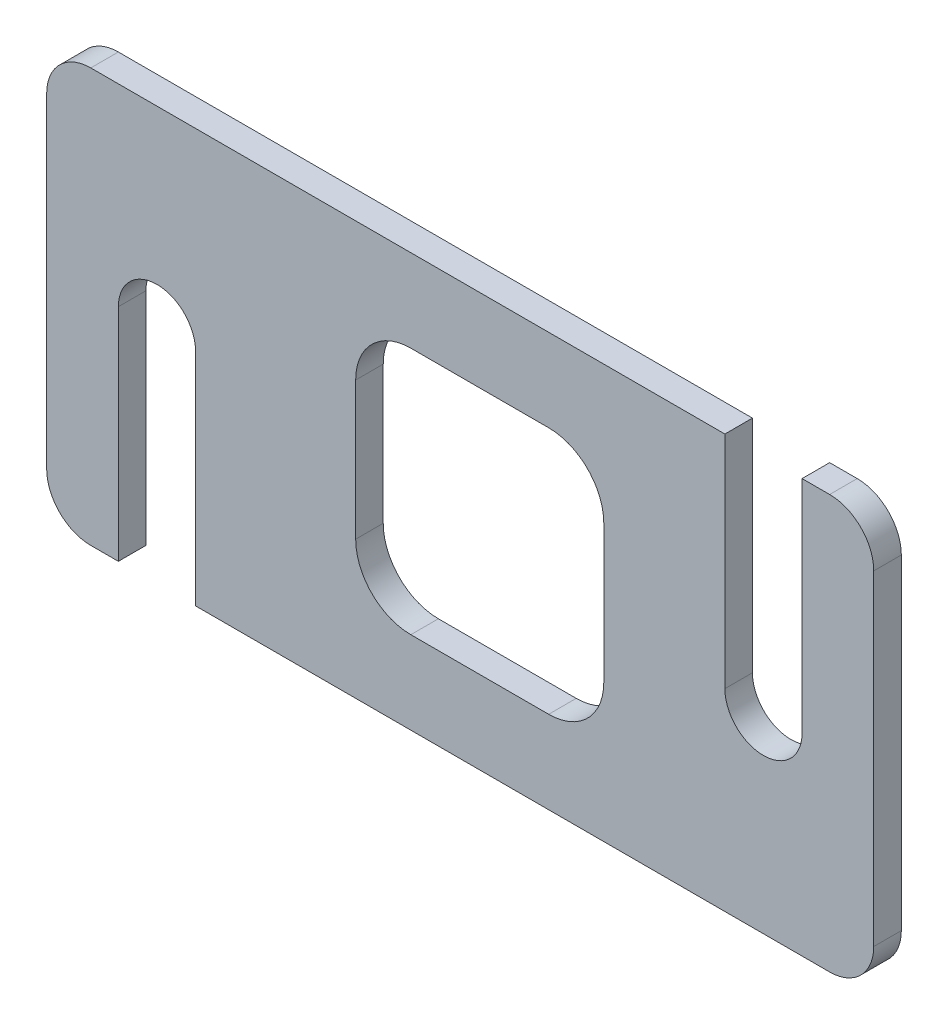
ISO-10303-21;
HEADER;
FILE_DESCRIPTION(('STEP AP214'),'2;1');
FILE_NAME('part.step','',(''),(''),'','','');
FILE_SCHEMA(('AUTOMOTIVE_DESIGN { 1 0 10303 214 1 1 1 1 }'));
ENDSEC;
DATA;
#1=APPLICATION_CONTEXT('core data for automotive mechanical design processes');
#2=APPLICATION_PROTOCOL_DEFINITION('international standard','automotive_design',2000,#1);
#3=PRODUCT_CONTEXT('',#1,'mechanical');
#4=PRODUCT('Part','Part','',(#3));
#5=PRODUCT_RELATED_PRODUCT_CATEGORY('part','',(#4));
#6=PRODUCT_DEFINITION_FORMATION('','',#4);
#7=PRODUCT_DEFINITION_CONTEXT('part definition',#1,'design');
#8=PRODUCT_DEFINITION('design','',#6,#7);
#9=PRODUCT_DEFINITION_SHAPE('','',#8);
#10=(LENGTH_UNIT() NAMED_UNIT(*) SI_UNIT(.MILLI.,.METRE.));
#11=(NAMED_UNIT(*) PLANE_ANGLE_UNIT() SI_UNIT($,.RADIAN.));
#12=(NAMED_UNIT(*) SI_UNIT($,.STERADIAN.) SOLID_ANGLE_UNIT());
#13=UNCERTAINTY_MEASURE_WITH_UNIT(LENGTH_MEASURE(1.E-05),#10,'distance_accuracy_value','');
#14=(GEOMETRIC_REPRESENTATION_CONTEXT(3) GLOBAL_UNCERTAINTY_ASSIGNED_CONTEXT((#13)) GLOBAL_UNIT_ASSIGNED_CONTEXT((#10,
#11,#12)) REPRESENTATION_CONTEXT('',''));
#15=CARTESIAN_POINT('',(0.,0.,0.));
#16=DIRECTION('',(0.,0.,1.));
#17=DIRECTION('',(1.,0.,0.));
#18=AXIS2_PLACEMENT_3D('',#15,#16,#17);
#19=CARTESIAN_POINT('',(150.,75.,5.));
#20=DIRECTION('',(0.,-1.,0.));
#21=DIRECTION('',(1.,0.,0.));
#22=AXIS2_PLACEMENT_3D('',#19,#20,#21);
#23=PLANE('',#22);
#24=DIRECTION('',(-1.,0.,0.));
#25=VECTOR('',#24,1.);
#26=CARTESIAN_POINT('',(150.,75.,5.));
#27=LINE('',#26,#25);
#28=CARTESIAN_POINT('',(142.,75.,5.));
#29=VERTEX_POINT('',#28);
#30=CARTESIAN_POINT('',(137.,75.,5.));
#31=VERTEX_POINT('',#30);
#32=EDGE_CURVE('E299',#29,#31,#27,.T.);
#33=ORIENTED_EDGE('',*,*,#32,.F.);
#34=DIRECTION('',(0.,0.,-1.));
#35=VECTOR('',#34,1.);
#36=CARTESIAN_POINT('',(142.,75.,5.));
#37=LINE('',#36,#35);
#38=CARTESIAN_POINT('',(142.,75.,0.));
#39=VERTEX_POINT('',#38);
#40=EDGE_CURVE('E335',#29,#39,#37,.T.);
#41=ORIENTED_EDGE('',*,*,#40,.T.);
#42=DIRECTION('',(-1.,0.,0.));
#43=VECTOR('',#42,1.);
#44=CARTESIAN_POINT('',(150.,75.,0.));
#45=LINE('',#44,#43);
#46=CARTESIAN_POINT('',(137.,75.,0.));
#47=VERTEX_POINT('',#46);
#48=EDGE_CURVE('E293',#39,#47,#45,.T.);
#49=ORIENTED_EDGE('',*,*,#48,.T.);
#50=DIRECTION('',(0.,0.,-1.));
#51=VECTOR('',#50,1.);
#52=CARTESIAN_POINT('',(137.,75.,220.974521694531));
#53=LINE('',#52,#51);
#54=EDGE_CURVE('E211',#31,#47,#53,.T.);
#55=ORIENTED_EDGE('',*,*,#54,.F.);
#56=EDGE_LOOP('',(#33,#41,#49,#55));
#57=FACE_BOUND('',#56,.T.);
#58=ADVANCED_FACE('F32',(#57),#23,.F.);
#59=CARTESIAN_POINT('',(0.,0.,5.));
#60=DIRECTION('',(0.,0.,1.));
#61=DIRECTION('',(1.,0.,0.));
#62=AXIS2_PLACEMENT_3D('',#59,#60,#61);
#63=PLANE('',#62);
#64=DIRECTION('',(1.,0.,0.));
#65=VECTOR('',#64,1.);
#66=CARTESIAN_POINT('',(66.0398643162599,15.,5.));
#67=LINE('',#66,#65);
#68=CARTESIAN_POINT('',(66.0398643162599,15.,5.));
#69=VERTEX_POINT('',#68);
#70=CARTESIAN_POINT('',(91.0398643162599,15.,5.));
#71=VERTEX_POINT('',#70);
#72=EDGE_CURVE('E232',#69,#71,#67,.T.);
#73=ORIENTED_EDGE('',*,*,#72,.F.);
#74=CARTESIAN_POINT('',(66.0398643162599,25.,5.));
#75=DIRECTION('',(0.,0.,1.));
#76=DIRECTION('',(1.,0.,0.));
#77=AXIS2_PLACEMENT_3D('',#74,#75,#76);
#78=CIRCLE('',#77,10.);
#79=CARTESIAN_POINT('',(56.0398643162599,25.,5.));
#80=VERTEX_POINT('',#79);
#81=EDGE_CURVE('E230',#80,#69,#78,.T.);
#82=ORIENTED_EDGE('',*,*,#81,.F.);
#83=DIRECTION('',(0.,-1.,0.));
#84=VECTOR('',#83,1.);
#85=CARTESIAN_POINT('',(56.0398643162599,50.,5.));
#86=LINE('',#85,#84);
#87=CARTESIAN_POINT('',(56.0398643162599,50.,5.));
#88=VERTEX_POINT('',#87);
#89=EDGE_CURVE('E247',#88,#80,#86,.T.);
#90=ORIENTED_EDGE('',*,*,#89,.F.);
#91=CARTESIAN_POINT('',(66.0398643162599,50.,5.));
#92=DIRECTION('',(0.,0.,-1.));
#93=DIRECTION('',(-1.,0.,0.));
#94=AXIS2_PLACEMENT_3D('',#91,#92,#93);
#95=CIRCLE('',#94,10.);
#96=CARTESIAN_POINT('',(66.0398643162599,60.,5.));
#97=VERTEX_POINT('',#96);
#98=EDGE_CURVE('E244',#88,#97,#95,.T.);
#99=ORIENTED_EDGE('',*,*,#98,.T.);
#100=DIRECTION('',(-1.,0.,0.));
#101=VECTOR('',#100,1.);
#102=CARTESIAN_POINT('',(91.0398643162599,60.,5.));
#103=LINE('',#102,#101);
#104=CARTESIAN_POINT('',(91.0398643162599,60.,5.));
#105=VERTEX_POINT('',#104);
#106=EDGE_CURVE('E242',#105,#97,#103,.T.);
#107=ORIENTED_EDGE('',*,*,#106,.F.);
#108=CARTESIAN_POINT('',(91.0398643162599,50.,5.));
#109=DIRECTION('',(0.,0.,1.));
#110=DIRECTION('',(1.,0.,0.));
#111=AXIS2_PLACEMENT_3D('',#108,#109,#110);
#112=CIRCLE('',#111,10.);
#113=CARTESIAN_POINT('',(101.03986431626,50.,5.));
#114=VERTEX_POINT('',#113);
#115=EDGE_CURVE('E240',#114,#105,#112,.T.);
#116=ORIENTED_EDGE('',*,*,#115,.F.);
#117=DIRECTION('',(0.,1.,0.));
#118=VECTOR('',#117,1.);
#119=CARTESIAN_POINT('',(101.03986431626,25.,5.));
#120=LINE('',#119,#118);
#121=CARTESIAN_POINT('',(101.03986431626,25.,5.));
#122=VERTEX_POINT('',#121);
#123=EDGE_CURVE('E238',#122,#114,#120,.T.);
#124=ORIENTED_EDGE('',*,*,#123,.F.);
#125=CARTESIAN_POINT('',(91.0398643162599,25.,5.));
#126=DIRECTION('',(0.,0.,-1.));
#127=DIRECTION('',(-1.,0.,0.));
#128=AXIS2_PLACEMENT_3D('',#125,#126,#127);
#129=CIRCLE('',#128,10.);
#130=EDGE_CURVE('E235',#122,#71,#129,.T.);
#131=ORIENTED_EDGE('',*,*,#130,.T.);
#132=EDGE_LOOP('',(#73,#82,#90,#99,#107,#116,#124,#131));
#133=FACE_BOUND('',#132,.T.);
#134=CARTESIAN_POINT('',(123.,75.,5.));
#135=VERTEX_POINT('',#134);
#136=CARTESIAN_POINT('',(8.00000000000001,75.,5.));
#137=VERTEX_POINT('',#136);
#138=EDGE_CURVE('E298',#135,#137,#27,.T.);
#139=ORIENTED_EDGE('',*,*,#138,.T.);
#140=CARTESIAN_POINT('',(8.,67.,5.));
#141=DIRECTION('',(0.,0.,1.));
#142=DIRECTION('',(1.,0.,0.));
#143=AXIS2_PLACEMENT_3D('',#140,#141,#142);
#144=CIRCLE('',#143,8.);
#145=CARTESIAN_POINT('',(0.,67.,5.));
#146=VERTEX_POINT('',#145);
#147=EDGE_CURVE('E11',#137,#146,#144,.T.);
#148=ORIENTED_EDGE('',*,*,#147,.T.);
#149=DIRECTION('',(0.,-1.,0.));
#150=VECTOR('',#149,1.);
#151=CARTESIAN_POINT('',(0.,75.,5.));
#152=LINE('',#151,#150);
#153=CARTESIAN_POINT('',(0.,7.99999999999999,5.));
#154=VERTEX_POINT('',#153);
#155=EDGE_CURVE('E290',#146,#154,#152,.T.);
#156=ORIENTED_EDGE('',*,*,#155,.T.);
#157=CARTESIAN_POINT('',(8.,8.,5.));
#158=DIRECTION('',(0.,0.,1.));
#159=DIRECTION('',(1.,0.,0.));
#160=AXIS2_PLACEMENT_3D('',#157,#158,#159);
#161=CIRCLE('',#160,8.);
#162=CARTESIAN_POINT('',(8.,0.,5.));
#163=VERTEX_POINT('',#162);
#164=EDGE_CURVE('E355',#154,#163,#161,.T.);
#165=ORIENTED_EDGE('',*,*,#164,.T.);
#166=DIRECTION('',(1.,0.,0.));
#167=VECTOR('',#166,1.);
#168=CARTESIAN_POINT('',(0.,0.,5.));
#169=LINE('',#168,#167);
#170=CARTESIAN_POINT('',(13.,0.,5.));
#171=VERTEX_POINT('',#170);
#172=EDGE_CURVE('E294',#163,#171,#169,.T.);
#173=ORIENTED_EDGE('',*,*,#172,.T.);
#174=DIRECTION('',(0.,1.,0.));
#175=VECTOR('',#174,1.);
#176=CARTESIAN_POINT('',(13.,0.,5.));
#177=LINE('',#176,#175);
#178=CARTESIAN_POINT('',(13.,40.,5.));
#179=VERTEX_POINT('',#178);
#180=EDGE_CURVE('E276',#171,#179,#177,.T.);
#181=ORIENTED_EDGE('',*,*,#180,.T.);
#182=CARTESIAN_POINT('',(20.,40.,5.));
#183=DIRECTION('',(0.,0.,1.));
#184=DIRECTION('',(1.,0.,0.));
#185=AXIS2_PLACEMENT_3D('',#182,#183,#184);
#186=CIRCLE('',#185,7.);
#187=CARTESIAN_POINT('',(27.,40.,5.));
#188=VERTEX_POINT('',#187);
#189=EDGE_CURVE('E287',#188,#179,#186,.T.);
#190=ORIENTED_EDGE('',*,*,#189,.F.);
#191=DIRECTION('',(0.,1.,0.));
#192=VECTOR('',#191,1.);
#193=CARTESIAN_POINT('',(27.,0.,5.));
#194=LINE('',#193,#192);
#195=CARTESIAN_POINT('',(27.,0.,5.));
#196=VERTEX_POINT('',#195);
#197=EDGE_CURVE('E233',#196,#188,#194,.T.);
#198=ORIENTED_EDGE('',*,*,#197,.F.);
#199=CARTESIAN_POINT('',(142.,0.,5.));
#200=VERTEX_POINT('',#199);
#201=EDGE_CURVE('E292',#196,#200,#169,.T.);
#202=ORIENTED_EDGE('',*,*,#201,.T.);
#203=CARTESIAN_POINT('',(142.,8.,5.));
#204=DIRECTION('',(0.,0.,1.));
#205=DIRECTION('',(1.,0.,0.));
#206=AXIS2_PLACEMENT_3D('',#203,#204,#205);
#207=CIRCLE('',#206,8.);
#208=CARTESIAN_POINT('',(150.,8.,5.));
#209=VERTEX_POINT('',#208);
#210=EDGE_CURVE('E364',#200,#209,#207,.T.);
#211=ORIENTED_EDGE('',*,*,#210,.T.);
#212=DIRECTION('',(0.,1.,0.));
#213=VECTOR('',#212,1.);
#214=CARTESIAN_POINT('',(150.,0.,5.));
#215=LINE('',#214,#213);
#216=CARTESIAN_POINT('',(150.,67.,5.));
#217=VERTEX_POINT('',#216);
#218=EDGE_CURVE('E296',#209,#217,#215,.T.);
#219=ORIENTED_EDGE('',*,*,#218,.T.);
#220=CARTESIAN_POINT('',(142.,67.,5.));
#221=DIRECTION('',(0.,0.,1.));
#222=DIRECTION('',(1.,0.,0.));
#223=AXIS2_PLACEMENT_3D('',#220,#221,#222);
#224=CIRCLE('',#223,8.);
#225=EDGE_CURVE('E344',#217,#29,#224,.T.);
#226=ORIENTED_EDGE('',*,*,#225,.T.);
#227=ORIENTED_EDGE('',*,*,#32,.T.);
#228=DIRECTION('',(0.,-1.,0.));
#229=VECTOR('',#228,1.);
#230=CARTESIAN_POINT('',(137.,0.,5.));
#231=LINE('',#230,#229);
#232=CARTESIAN_POINT('',(137.,35.,5.));
#233=VERTEX_POINT('',#232);
#234=EDGE_CURVE('E224',#31,#233,#231,.T.);
#235=ORIENTED_EDGE('',*,*,#234,.T.);
#236=CARTESIAN_POINT('',(130.,35.,5.));
#237=DIRECTION('',(0.,0.,1.));
#238=DIRECTION('',(1.,0.,0.));
#239=AXIS2_PLACEMENT_3D('',#236,#237,#238);
#240=CIRCLE('',#239,7.00000000000002);
#241=CARTESIAN_POINT('',(123.,35.,5.));
#242=VERTEX_POINT('',#241);
#243=EDGE_CURVE('E216',#233,#242,#240,.F.);
#244=ORIENTED_EDGE('',*,*,#243,.T.);
#245=DIRECTION('',(0.,1.,0.));
#246=VECTOR('',#245,1.);
#247=CARTESIAN_POINT('',(123.,0.,5.));
#248=LINE('',#247,#246);
#249=EDGE_CURVE('E227',#242,#135,#248,.T.);
#250=ORIENTED_EDGE('',*,*,#249,.T.);
#251=EDGE_LOOP('',(#139,#148,#156,#165,#173,#181,#190,#198,#202,#211,#219,#226,#227,#235,#244,#250));
#252=FACE_BOUND('',#251,.T.);
#253=ADVANCED_FACE('F383',(#133,#252),#63,.T.);
#254=CARTESIAN_POINT('',(0.,0.,0.));
#255=DIRECTION('',(0.,0.,1.));
#256=DIRECTION('',(1.,0.,0.));
#257=AXIS2_PLACEMENT_3D('',#254,#255,#256);
#258=PLANE('',#257);
#259=CARTESIAN_POINT('',(66.0398643162599,25.,0.));
#260=DIRECTION('',(0.,0.,-1.));
#261=DIRECTION('',(-1.,0.,0.));
#262=AXIS2_PLACEMENT_3D('',#259,#260,#261);
#263=CIRCLE('',#262,10.);
#264=CARTESIAN_POINT('',(66.0398643162599,15.,0.));
#265=VERTEX_POINT('',#264);
#266=CARTESIAN_POINT('',(56.0398643162599,25.,0.));
#267=VERTEX_POINT('',#266);
#268=EDGE_CURVE('E212',#265,#267,#263,.T.);
#269=ORIENTED_EDGE('',*,*,#268,.F.);
#270=DIRECTION('',(1.,0.,0.));
#271=VECTOR('',#270,1.);
#272=CARTESIAN_POINT('',(66.0398643162599,15.,0.));
#273=LINE('',#272,#271);
#274=CARTESIAN_POINT('',(91.0398643162599,15.,0.));
#275=VERTEX_POINT('',#274);
#276=EDGE_CURVE('E330',#275,#265,#273,.F.);
#277=ORIENTED_EDGE('',*,*,#276,.F.);
#278=CARTESIAN_POINT('',(91.0398643162599,25.,0.));
#279=DIRECTION('',(0.,0.,-1.));
#280=DIRECTION('',(-1.,0.,0.));
#281=AXIS2_PLACEMENT_3D('',#278,#279,#280);
#282=CIRCLE('',#281,10.);
#283=CARTESIAN_POINT('',(101.03986431626,25.,0.));
#284=VERTEX_POINT('',#283);
#285=EDGE_CURVE('E327',#275,#284,#282,.F.);
#286=ORIENTED_EDGE('',*,*,#285,.T.);
#287=DIRECTION('',(0.,1.,0.));
#288=VECTOR('',#287,1.);
#289=CARTESIAN_POINT('',(101.03986431626,25.,0.));
#290=LINE('',#289,#288);
#291=CARTESIAN_POINT('',(101.03986431626,50.,0.));
#292=VERTEX_POINT('',#291);
#293=EDGE_CURVE('E325',#292,#284,#290,.F.);
#294=ORIENTED_EDGE('',*,*,#293,.F.);
#295=CARTESIAN_POINT('',(91.0398643162599,50.,0.));
#296=DIRECTION('',(0.,0.,-1.));
#297=DIRECTION('',(-1.,0.,0.));
#298=AXIS2_PLACEMENT_3D('',#295,#296,#297);
#299=CIRCLE('',#298,10.);
#300=CARTESIAN_POINT('',(91.0398643162599,60.,0.));
#301=VERTEX_POINT('',#300);
#302=EDGE_CURVE('E323',#301,#292,#299,.T.);
#303=ORIENTED_EDGE('',*,*,#302,.F.);
#304=DIRECTION('',(1.,0.,0.));
#305=VECTOR('',#304,1.);
#306=CARTESIAN_POINT('',(91.0398643162599,60.,0.));
#307=LINE('',#306,#305);
#308=CARTESIAN_POINT('',(66.0398643162599,60.,0.));
#309=VERTEX_POINT('',#308);
#310=EDGE_CURVE('E321',#309,#301,#307,.T.);
#311=ORIENTED_EDGE('',*,*,#310,.F.);
#312=CARTESIAN_POINT('',(66.0398643162599,50.,0.));
#313=DIRECTION('',(0.,0.,-1.));
#314=DIRECTION('',(-1.,0.,0.));
#315=AXIS2_PLACEMENT_3D('',#312,#313,#314);
#316=CIRCLE('',#315,10.);
#317=CARTESIAN_POINT('',(56.0398643162599,50.,0.));
#318=VERTEX_POINT('',#317);
#319=EDGE_CURVE('E318',#309,#318,#316,.F.);
#320=ORIENTED_EDGE('',*,*,#319,.T.);
#321=DIRECTION('',(0.,1.,0.));
#322=VECTOR('',#321,1.);
#323=CARTESIAN_POINT('',(56.0398643162599,50.,0.));
#324=LINE('',#323,#322);
#325=EDGE_CURVE('E316',#267,#318,#324,.T.);
#326=ORIENTED_EDGE('',*,*,#325,.F.);
#327=EDGE_LOOP('',(#269,#277,#286,#294,#303,#311,#320,#326));
#328=FACE_BOUND('',#327,.T.);
#329=DIRECTION('',(0.,-1.,0.));
#330=VECTOR('',#329,1.);
#331=CARTESIAN_POINT('',(0.,75.,0.));
#332=LINE('',#331,#330);
#333=CARTESIAN_POINT('',(0.,67.,0.));
#334=VERTEX_POINT('',#333);
#335=CARTESIAN_POINT('',(0.,7.99999999999999,0.));
#336=VERTEX_POINT('',#335);
#337=EDGE_CURVE('E253',#334,#336,#332,.T.);
#338=ORIENTED_EDGE('',*,*,#337,.F.);
#339=CARTESIAN_POINT('',(8.,67.,0.));
#340=DIRECTION('',(0.,0.,1.));
#341=DIRECTION('',(1.,0.,0.));
#342=AXIS2_PLACEMENT_3D('',#339,#340,#341);
#343=CIRCLE('',#342,8.);
#344=CARTESIAN_POINT('',(8.00000000000001,75.,0.));
#345=VERTEX_POINT('',#344);
#346=EDGE_CURVE('E54',#334,#345,#343,.F.);
#347=ORIENTED_EDGE('',*,*,#346,.T.);
#348=CARTESIAN_POINT('',(123.,75.,0.));
#349=VERTEX_POINT('',#348);
#350=EDGE_CURVE('E308',#349,#345,#45,.T.);
#351=ORIENTED_EDGE('',*,*,#350,.F.);
#352=DIRECTION('',(0.,1.,0.));
#353=VECTOR('',#352,1.);
#354=CARTESIAN_POINT('',(123.,0.,0.));
#355=LINE('',#354,#353);
#356=CARTESIAN_POINT('',(123.,35.,0.));
#357=VERTEX_POINT('',#356);
#358=EDGE_CURVE('E199',#357,#349,#355,.T.);
#359=ORIENTED_EDGE('',*,*,#358,.F.);
#360=CARTESIAN_POINT('',(130.,35.,0.));
#361=DIRECTION('',(0.,0.,1.));
#362=DIRECTION('',(1.,0.,0.));
#363=AXIS2_PLACEMENT_3D('',#360,#361,#362);
#364=CIRCLE('',#363,7.00000000000002);
#365=CARTESIAN_POINT('',(137.,35.,0.));
#366=VERTEX_POINT('',#365);
#367=EDGE_CURVE('E192',#366,#357,#364,.F.);
#368=ORIENTED_EDGE('',*,*,#367,.F.);
#369=DIRECTION('',(0.,-1.,0.));
#370=VECTOR('',#369,1.);
#371=CARTESIAN_POINT('',(137.,0.,0.));
#372=LINE('',#371,#370);
#373=EDGE_CURVE('E196',#47,#366,#372,.T.);
#374=ORIENTED_EDGE('',*,*,#373,.F.);
#375=ORIENTED_EDGE('',*,*,#48,.F.);
#376=CARTESIAN_POINT('',(142.,67.,0.));
#377=DIRECTION('',(0.,0.,1.));
#378=DIRECTION('',(1.,0.,0.));
#379=AXIS2_PLACEMENT_3D('',#376,#377,#378);
#380=CIRCLE('',#379,8.);
#381=CARTESIAN_POINT('',(150.,67.,0.));
#382=VERTEX_POINT('',#381);
#383=EDGE_CURVE('E338',#39,#382,#380,.F.);
#384=ORIENTED_EDGE('',*,*,#383,.T.);
#385=DIRECTION('',(0.,1.,0.));
#386=VECTOR('',#385,1.);
#387=CARTESIAN_POINT('',(150.,0.,0.));
#388=LINE('',#387,#386);
#389=CARTESIAN_POINT('',(150.,8.,0.));
#390=VERTEX_POINT('',#389);
#391=EDGE_CURVE('E306',#390,#382,#388,.T.);
#392=ORIENTED_EDGE('',*,*,#391,.F.);
#393=CARTESIAN_POINT('',(142.,8.,0.));
#394=DIRECTION('',(0.,0.,1.));
#395=DIRECTION('',(1.,0.,0.));
#396=AXIS2_PLACEMENT_3D('',#393,#394,#395);
#397=CIRCLE('',#396,8.);
#398=CARTESIAN_POINT('',(142.,0.,0.));
#399=VERTEX_POINT('',#398);
#400=EDGE_CURVE('E360',#390,#399,#397,.F.);
#401=ORIENTED_EDGE('',*,*,#400,.T.);
#402=DIRECTION('',(1.,0.,0.));
#403=VECTOR('',#402,1.);
#404=CARTESIAN_POINT('',(0.,0.,0.));
#405=LINE('',#404,#403);
#406=CARTESIAN_POINT('',(27.,0.,0.));
#407=VERTEX_POINT('',#406);
#408=EDGE_CURVE('E303',#407,#399,#405,.T.);
#409=ORIENTED_EDGE('',*,*,#408,.F.);
#410=DIRECTION('',(0.,1.,0.));
#411=VECTOR('',#410,1.);
#412=CARTESIAN_POINT('',(27.,0.,0.));
#413=LINE('',#412,#411);
#414=CARTESIAN_POINT('',(27.,40.,0.));
#415=VERTEX_POINT('',#414);
#416=EDGE_CURVE('E314',#415,#407,#413,.F.);
#417=ORIENTED_EDGE('',*,*,#416,.F.);
#418=CARTESIAN_POINT('',(20.,40.,0.));
#419=DIRECTION('',(0.,0.,-1.));
#420=DIRECTION('',(-1.,0.,0.));
#421=AXIS2_PLACEMENT_3D('',#418,#419,#420);
#422=CIRCLE('',#421,7.);
#423=CARTESIAN_POINT('',(13.,40.,0.));
#424=VERTEX_POINT('',#423);
#425=EDGE_CURVE('E312',#424,#415,#422,.T.);
#426=ORIENTED_EDGE('',*,*,#425,.F.);
#427=DIRECTION('',(0.,1.,0.));
#428=VECTOR('',#427,1.);
#429=CARTESIAN_POINT('',(13.,0.,0.));
#430=LINE('',#429,#428);
#431=CARTESIAN_POINT('',(13.,0.,0.));
#432=VERTEX_POINT('',#431);
#433=EDGE_CURVE('E301',#424,#432,#430,.F.);
#434=ORIENTED_EDGE('',*,*,#433,.T.);
#435=CARTESIAN_POINT('',(8.,0.,0.));
#436=VERTEX_POINT('',#435);
#437=EDGE_CURVE('E304',#436,#432,#405,.T.);
#438=ORIENTED_EDGE('',*,*,#437,.F.);
#439=CARTESIAN_POINT('',(8.,8.,0.));
#440=DIRECTION('',(0.,0.,1.));
#441=DIRECTION('',(1.,0.,0.));
#442=AXIS2_PLACEMENT_3D('',#439,#440,#441);
#443=CIRCLE('',#442,8.);
#444=EDGE_CURVE('E349',#436,#336,#443,.F.);
#445=ORIENTED_EDGE('',*,*,#444,.T.);
#446=EDGE_LOOP('',(#338,#347,#351,#359,#368,#374,#375,#384,#392,#401,#409,#417,#426,#434,#438,#445));
#447=FACE_BOUND('',#446,.T.);
#448=ADVANCED_FACE('F194',(#328,#447),#258,.F.);
#449=CARTESIAN_POINT('',(0.,0.,5.));
#450=DIRECTION('',(0.,1.,0.));
#451=DIRECTION('',(0.,0.,1.));
#452=AXIS2_PLACEMENT_3D('',#449,#450,#451);
#453=PLANE('',#452);
#454=ORIENTED_EDGE('',*,*,#408,.T.);
#455=DIRECTION('',(0.,0.,-1.));
#456=VECTOR('',#455,1.);
#457=CARTESIAN_POINT('',(142.,0.,5.));
#458=LINE('',#457,#456);
#459=EDGE_CURVE('E362',#399,#200,#458,.F.);
#460=ORIENTED_EDGE('',*,*,#459,.T.);
#461=ORIENTED_EDGE('',*,*,#201,.F.);
#462=DIRECTION('',(0.,0.,-1.));
#463=VECTOR('',#462,1.);
#464=CARTESIAN_POINT('',(27.,0.,5.));
#465=LINE('',#464,#463);
#466=EDGE_CURVE('E229',#196,#407,#465,.T.);
#467=ORIENTED_EDGE('',*,*,#466,.T.);
#468=EDGE_LOOP('',(#454,#460,#461,#467));
#469=FACE_BOUND('',#468,.T.);
#470=ADVANCED_FACE('F406',(#469),#453,.F.);
#471=CARTESIAN_POINT('',(0.,75.,5.));
#472=DIRECTION('',(1.,0.,0.));
#473=DIRECTION('',(0.,1.,0.));
#474=AXIS2_PLACEMENT_3D('',#471,#472,#473);
#475=PLANE('',#474);
#476=ORIENTED_EDGE('',*,*,#155,.F.);
#477=DIRECTION('',(0.,0.,-1.));
#478=VECTOR('',#477,1.);
#479=CARTESIAN_POINT('',(0.,67.,5.));
#480=LINE('',#479,#478);
#481=EDGE_CURVE('E366',#146,#334,#480,.T.);
#482=ORIENTED_EDGE('',*,*,#481,.T.);
#483=ORIENTED_EDGE('',*,*,#337,.T.);
#484=DIRECTION('',(0.,0.,-1.));
#485=VECTOR('',#484,1.);
#486=CARTESIAN_POINT('',(0.,7.99999999999999,5.));
#487=LINE('',#486,#485);
#488=EDGE_CURVE('E352',#336,#154,#487,.F.);
#489=ORIENTED_EDGE('',*,*,#488,.T.);
#490=EDGE_LOOP('',(#476,#482,#483,#489));
#491=FACE_BOUND('',#490,.T.);
#492=ADVANCED_FACE('F372',(#491),#475,.F.);
#493=ORIENTED_EDGE('',*,*,#172,.F.);
#494=DIRECTION('',(0.,0.,-1.));
#495=VECTOR('',#494,1.);
#496=CARTESIAN_POINT('',(8.,0.,5.));
#497=LINE('',#496,#495);
#498=EDGE_CURVE('E346',#163,#436,#497,.T.);
#499=ORIENTED_EDGE('',*,*,#498,.T.);
#500=ORIENTED_EDGE('',*,*,#437,.T.);
#501=DIRECTION('',(0.,0.,-1.));
#502=VECTOR('',#501,1.);
#503=CARTESIAN_POINT('',(13.,0.,5.));
#504=LINE('',#503,#502);
#505=EDGE_CURVE('E273',#171,#432,#504,.T.);
#506=ORIENTED_EDGE('',*,*,#505,.F.);
#507=EDGE_LOOP('',(#493,#499,#500,#506));
#508=FACE_BOUND('',#507,.T.);
#509=ADVANCED_FACE('F387',(#508),#453,.F.);
#510=CARTESIAN_POINT('',(150.,0.,5.));
#511=DIRECTION('',(-1.,0.,0.));
#512=DIRECTION('',(0.,0.,1.));
#513=AXIS2_PLACEMENT_3D('',#510,#511,#512);
#514=PLANE('',#513);
#515=ORIENTED_EDGE('',*,*,#218,.F.);
#516=DIRECTION('',(0.,0.,-1.));
#517=VECTOR('',#516,1.);
#518=CARTESIAN_POINT('',(150.,8.,5.));
#519=LINE('',#518,#517);
#520=EDGE_CURVE('E357',#209,#390,#519,.T.);
#521=ORIENTED_EDGE('',*,*,#520,.T.);
#522=ORIENTED_EDGE('',*,*,#391,.T.);
#523=DIRECTION('',(0.,0.,-1.));
#524=VECTOR('',#523,1.);
#525=CARTESIAN_POINT('',(150.,67.,5.));
#526=LINE('',#525,#524);
#527=EDGE_CURVE('E341',#382,#217,#526,.F.);
#528=ORIENTED_EDGE('',*,*,#527,.T.);
#529=EDGE_LOOP('',(#515,#521,#522,#528));
#530=FACE_BOUND('',#529,.T.);
#531=ADVANCED_FACE('F413',(#530),#514,.F.);
#532=ORIENTED_EDGE('',*,*,#350,.T.);
#533=DIRECTION('',(0.,0.,-1.));
#534=VECTOR('',#533,1.);
#535=CARTESIAN_POINT('',(8.00000000000001,75.,5.));
#536=LINE('',#535,#534);
#537=EDGE_CURVE('E40',#345,#137,#536,.F.);
#538=ORIENTED_EDGE('',*,*,#537,.T.);
#539=ORIENTED_EDGE('',*,*,#138,.F.);
#540=DIRECTION('',(0.,0.,-1.));
#541=VECTOR('',#540,1.);
#542=CARTESIAN_POINT('',(123.,75.,220.974521694531));
#543=LINE('',#542,#541);
#544=EDGE_CURVE('E222',#135,#349,#543,.T.);
#545=ORIENTED_EDGE('',*,*,#544,.T.);
#546=EDGE_LOOP('',(#532,#538,#539,#545));
#547=FACE_BOUND('',#546,.T.);
#548=ADVANCED_FACE('F426',(#547),#23,.F.);
#549=CARTESIAN_POINT('',(27.,0.,5.));
#550=DIRECTION('',(-1.,0.,0.));
#551=DIRECTION('',(0.,0.,1.));
#552=AXIS2_PLACEMENT_3D('',#549,#550,#551);
#553=PLANE('',#552);
#554=ORIENTED_EDGE('',*,*,#416,.T.);
#555=ORIENTED_EDGE('',*,*,#466,.F.);
#556=ORIENTED_EDGE('',*,*,#197,.T.);
#557=DIRECTION('',(0.,0.,-1.));
#558=VECTOR('',#557,1.);
#559=CARTESIAN_POINT('',(27.,40.,5.));
#560=LINE('',#559,#558);
#561=EDGE_CURVE('E280',#188,#415,#560,.T.);
#562=ORIENTED_EDGE('',*,*,#561,.T.);
#563=EDGE_LOOP('',(#554,#555,#556,#562));
#564=FACE_BOUND('',#563,.T.);
#565=ADVANCED_FACE('F399',(#564),#553,.T.);
#566=CARTESIAN_POINT('',(20.,40.,5.));
#567=DIRECTION('',(0.,0.,-1.));
#568=DIRECTION('',(-1.,0.,0.));
#569=AXIS2_PLACEMENT_3D('',#566,#567,#568);
#570=CYLINDRICAL_SURFACE('',#569,7.);
#571=ORIENTED_EDGE('',*,*,#425,.T.);
#572=ORIENTED_EDGE('',*,*,#561,.F.);
#573=ORIENTED_EDGE('',*,*,#189,.T.);
#574=DIRECTION('',(0.,0.,-1.));
#575=VECTOR('',#574,1.);
#576=CARTESIAN_POINT('',(13.,40.,5.));
#577=LINE('',#576,#575);
#578=EDGE_CURVE('E277',#179,#424,#577,.T.);
#579=ORIENTED_EDGE('',*,*,#578,.T.);
#580=EDGE_LOOP('',(#571,#572,#573,#579));
#581=FACE_BOUND('',#580,.T.);
#582=ADVANCED_FACE('F396',(#581),#570,.F.);
#583=CARTESIAN_POINT('',(13.,0.,5.));
#584=DIRECTION('',(-1.,0.,0.));
#585=DIRECTION('',(0.,0.,1.));
#586=AXIS2_PLACEMENT_3D('',#583,#584,#585);
#587=PLANE('',#586);
#588=ORIENTED_EDGE('',*,*,#578,.F.);
#589=ORIENTED_EDGE('',*,*,#180,.F.);
#590=ORIENTED_EDGE('',*,*,#505,.T.);
#591=ORIENTED_EDGE('',*,*,#433,.F.);
#592=EDGE_LOOP('',(#588,#589,#590,#591));
#593=FACE_BOUND('',#592,.T.);
#594=ADVANCED_FACE('F390',(#593),#587,.F.);
#595=CARTESIAN_POINT('',(66.0398643162599,25.,5.));
#596=DIRECTION('',(0.,0.,-1.));
#597=DIRECTION('',(-1.,0.,0.));
#598=AXIS2_PLACEMENT_3D('',#595,#596,#597);
#599=CYLINDRICAL_SURFACE('',#598,10.);
#600=ORIENTED_EDGE('',*,*,#268,.T.);
#601=DIRECTION('',(0.,0.,-1.));
#602=VECTOR('',#601,1.);
#603=CARTESIAN_POINT('',(56.0398643162599,25.,5.));
#604=LINE('',#603,#602);
#605=EDGE_CURVE('E249',#80,#267,#604,.T.);
#606=ORIENTED_EDGE('',*,*,#605,.F.);
#607=ORIENTED_EDGE('',*,*,#81,.T.);
#608=DIRECTION('',(0.,0.,-1.));
#609=VECTOR('',#608,1.);
#610=CARTESIAN_POINT('',(66.0398643162599,15.,5.));
#611=LINE('',#610,#609);
#612=EDGE_CURVE('E250',#69,#265,#611,.T.);
#613=ORIENTED_EDGE('',*,*,#612,.T.);
#614=EDGE_LOOP('',(#600,#606,#607,#613));
#615=FACE_BOUND('',#614,.T.);
#616=ADVANCED_FACE('F529',(#615),#599,.F.);
#617=CARTESIAN_POINT('',(66.0398643162599,15.,5.));
#618=DIRECTION('',(0.,1.,0.));
#619=DIRECTION('',(0.,0.,1.));
#620=AXIS2_PLACEMENT_3D('',#617,#618,#619);
#621=PLANE('',#620);
#622=ORIENTED_EDGE('',*,*,#276,.T.);
#623=ORIENTED_EDGE('',*,*,#612,.F.);
#624=ORIENTED_EDGE('',*,*,#72,.T.);
#625=DIRECTION('',(0.,0.,-1.));
#626=VECTOR('',#625,1.);
#627=CARTESIAN_POINT('',(91.0398643162599,15.,5.));
#628=LINE('',#627,#626);
#629=EDGE_CURVE('E254',#71,#275,#628,.T.);
#630=ORIENTED_EDGE('',*,*,#629,.T.);
#631=EDGE_LOOP('',(#622,#623,#624,#630));
#632=FACE_BOUND('',#631,.T.);
#633=ADVANCED_FACE('F537',(#632),#621,.T.);
#634=CARTESIAN_POINT('',(91.0398643162599,25.,5.));
#635=DIRECTION('',(0.,0.,-1.));
#636=DIRECTION('',(-1.,0.,0.));
#637=AXIS2_PLACEMENT_3D('',#634,#635,#636);
#638=CYLINDRICAL_SURFACE('',#637,10.);
#639=ORIENTED_EDGE('',*,*,#629,.F.);
#640=ORIENTED_EDGE('',*,*,#130,.F.);
#641=DIRECTION('',(0.,0.,-1.));
#642=VECTOR('',#641,1.);
#643=CARTESIAN_POINT('',(101.03986431626,25.,5.));
#644=LINE('',#643,#642);
#645=EDGE_CURVE('E257',#122,#284,#644,.T.);
#646=ORIENTED_EDGE('',*,*,#645,.T.);
#647=ORIENTED_EDGE('',*,*,#285,.F.);
#648=EDGE_LOOP('',(#639,#640,#646,#647));
#649=FACE_BOUND('',#648,.T.);
#650=ADVANCED_FACE('F546',(#649),#638,.F.);
#651=CARTESIAN_POINT('',(101.03986431626,25.,5.));
#652=DIRECTION('',(-1.,0.,0.));
#653=DIRECTION('',(0.,0.,1.));
#654=AXIS2_PLACEMENT_3D('',#651,#652,#653);
#655=PLANE('',#654);
#656=ORIENTED_EDGE('',*,*,#293,.T.);
#657=ORIENTED_EDGE('',*,*,#645,.F.);
#658=ORIENTED_EDGE('',*,*,#123,.T.);
#659=DIRECTION('',(0.,0.,-1.));
#660=VECTOR('',#659,1.);
#661=CARTESIAN_POINT('',(101.03986431626,50.,5.));
#662=LINE('',#661,#660);
#663=EDGE_CURVE('E260',#114,#292,#662,.T.);
#664=ORIENTED_EDGE('',*,*,#663,.T.);
#665=EDGE_LOOP('',(#656,#657,#658,#664));
#666=FACE_BOUND('',#665,.T.);
#667=ADVANCED_FACE('F555',(#666),#655,.T.);
#668=CARTESIAN_POINT('',(91.0398643162599,50.,5.));
#669=DIRECTION('',(0.,0.,-1.));
#670=DIRECTION('',(-1.,0.,0.));
#671=AXIS2_PLACEMENT_3D('',#668,#669,#670);
#672=CYLINDRICAL_SURFACE('',#671,10.);
#673=ORIENTED_EDGE('',*,*,#302,.T.);
#674=ORIENTED_EDGE('',*,*,#663,.F.);
#675=ORIENTED_EDGE('',*,*,#115,.T.);
#676=DIRECTION('',(0.,0.,-1.));
#677=VECTOR('',#676,1.);
#678=CARTESIAN_POINT('',(91.0398643162599,60.,5.));
#679=LINE('',#678,#677);
#680=EDGE_CURVE('E265',#105,#301,#679,.T.);
#681=ORIENTED_EDGE('',*,*,#680,.T.);
#682=EDGE_LOOP('',(#673,#674,#675,#681));
#683=FACE_BOUND('',#682,.T.);
#684=ADVANCED_FACE('F564',(#683),#672,.F.);
#685=CARTESIAN_POINT('',(91.0398643162599,60.,5.));
#686=DIRECTION('',(0.,-1.,0.));
#687=DIRECTION('',(0.,0.,-1.));
#688=AXIS2_PLACEMENT_3D('',#685,#686,#687);
#689=PLANE('',#688);
#690=ORIENTED_EDGE('',*,*,#310,.T.);
#691=ORIENTED_EDGE('',*,*,#680,.F.);
#692=ORIENTED_EDGE('',*,*,#106,.T.);
#693=DIRECTION('',(0.,0.,-1.));
#694=VECTOR('',#693,1.);
#695=CARTESIAN_POINT('',(66.0398643162599,60.,5.));
#696=LINE('',#695,#694);
#697=EDGE_CURVE('E268',#97,#309,#696,.T.);
#698=ORIENTED_EDGE('',*,*,#697,.T.);
#699=EDGE_LOOP('',(#690,#691,#692,#698));
#700=FACE_BOUND('',#699,.T.);
#701=ADVANCED_FACE('F573',(#700),#689,.T.);
#702=CARTESIAN_POINT('',(66.0398643162599,50.,5.));
#703=DIRECTION('',(0.,0.,-1.));
#704=DIRECTION('',(-1.,0.,0.));
#705=AXIS2_PLACEMENT_3D('',#702,#703,#704);
#706=CYLINDRICAL_SURFACE('',#705,10.);
#707=ORIENTED_EDGE('',*,*,#697,.F.);
#708=ORIENTED_EDGE('',*,*,#98,.F.);
#709=DIRECTION('',(0.,0.,-1.));
#710=VECTOR('',#709,1.);
#711=CARTESIAN_POINT('',(56.0398643162599,50.,5.));
#712=LINE('',#711,#710);
#713=EDGE_CURVE('E262',#88,#318,#712,.T.);
#714=ORIENTED_EDGE('',*,*,#713,.T.);
#715=ORIENTED_EDGE('',*,*,#319,.F.);
#716=EDGE_LOOP('',(#707,#708,#714,#715));
#717=FACE_BOUND('',#716,.T.);
#718=ADVANCED_FACE('F582',(#717),#706,.F.);
#719=CARTESIAN_POINT('',(56.0398643162599,50.,5.));
#720=DIRECTION('',(1.,0.,0.));
#721=DIRECTION('',(0.,1.,0.));
#722=AXIS2_PLACEMENT_3D('',#719,#720,#721);
#723=PLANE('',#722);
#724=ORIENTED_EDGE('',*,*,#325,.T.);
#725=ORIENTED_EDGE('',*,*,#713,.F.);
#726=ORIENTED_EDGE('',*,*,#89,.T.);
#727=ORIENTED_EDGE('',*,*,#605,.T.);
#728=EDGE_LOOP('',(#724,#725,#726,#727));
#729=FACE_BOUND('',#728,.T.);
#730=ADVANCED_FACE('F590',(#729),#723,.T.);
#731=CARTESIAN_POINT('',(123.,75.,220.974521694531));
#732=DIRECTION('',(1.,0.,0.));
#733=DIRECTION('',(0.,0.,-1.));
#734=AXIS2_PLACEMENT_3D('',#731,#732,#733);
#735=PLANE('',#734);
#736=ORIENTED_EDGE('',*,*,#249,.F.);
#737=DIRECTION('',(0.,0.,-1.));
#738=VECTOR('',#737,1.);
#739=CARTESIAN_POINT('',(123.,35.,220.974521694531));
#740=LINE('',#739,#738);
#741=EDGE_CURVE('E218',#242,#357,#740,.T.);
#742=ORIENTED_EDGE('',*,*,#741,.T.);
#743=ORIENTED_EDGE('',*,*,#358,.T.);
#744=ORIENTED_EDGE('',*,*,#544,.F.);
#745=EDGE_LOOP('',(#736,#742,#743,#744));
#746=FACE_BOUND('',#745,.T.);
#747=ADVANCED_FACE('F425',(#746),#735,.T.);
#748=CARTESIAN_POINT('',(130.,35.,220.974521694531));
#749=DIRECTION('',(0.,0.,-1.));
#750=DIRECTION('',(-1.,0.,0.));
#751=AXIS2_PLACEMENT_3D('',#748,#749,#750);
#752=CYLINDRICAL_SURFACE('',#751,7.00000000000002);
#753=ORIENTED_EDGE('',*,*,#243,.F.);
#754=DIRECTION('',(0.,0.,-1.));
#755=VECTOR('',#754,1.);
#756=CARTESIAN_POINT('',(137.,35.,220.974521694531));
#757=LINE('',#756,#755);
#758=EDGE_CURVE('E209',#233,#366,#757,.T.);
#759=ORIENTED_EDGE('',*,*,#758,.T.);
#760=ORIENTED_EDGE('',*,*,#367,.T.);
#761=ORIENTED_EDGE('',*,*,#741,.F.);
#762=EDGE_LOOP('',(#753,#759,#760,#761));
#763=FACE_BOUND('',#762,.T.);
#764=ADVANCED_FACE('F215',(#763),#752,.F.);
#765=CARTESIAN_POINT('',(137.,35.,220.974521694531));
#766=DIRECTION('',(-1.,0.,0.));
#767=DIRECTION('',(0.,0.,1.));
#768=AXIS2_PLACEMENT_3D('',#765,#766,#767);
#769=PLANE('',#768);
#770=ORIENTED_EDGE('',*,*,#234,.F.);
#771=ORIENTED_EDGE('',*,*,#54,.T.);
#772=ORIENTED_EDGE('',*,*,#373,.T.);
#773=ORIENTED_EDGE('',*,*,#758,.F.);
#774=EDGE_LOOP('',(#770,#771,#772,#773));
#775=FACE_BOUND('',#774,.T.);
#776=ADVANCED_FACE('F208',(#775),#769,.T.);
#777=CARTESIAN_POINT('',(142.,67.,5.));
#778=DIRECTION('',(0.,0.,-1.));
#779=DIRECTION('',(-1.,0.,0.));
#780=AXIS2_PLACEMENT_3D('',#777,#778,#779);
#781=CYLINDRICAL_SURFACE('',#780,8.);
#782=ORIENTED_EDGE('',*,*,#225,.F.);
#783=ORIENTED_EDGE('',*,*,#527,.F.);
#784=ORIENTED_EDGE('',*,*,#383,.F.);
#785=ORIENTED_EDGE('',*,*,#40,.F.);
#786=EDGE_LOOP('',(#782,#783,#784,#785));
#787=FACE_BOUND('',#786,.T.);
#788=ADVANCED_FACE('F419',(#787),#781,.T.);
#789=CARTESIAN_POINT('',(8.,8.,5.));
#790=DIRECTION('',(0.,0.,-1.));
#791=DIRECTION('',(-1.,0.,0.));
#792=AXIS2_PLACEMENT_3D('',#789,#790,#791);
#793=CYLINDRICAL_SURFACE('',#792,8.);
#794=ORIENTED_EDGE('',*,*,#164,.F.);
#795=ORIENTED_EDGE('',*,*,#488,.F.);
#796=ORIENTED_EDGE('',*,*,#444,.F.);
#797=ORIENTED_EDGE('',*,*,#498,.F.);
#798=EDGE_LOOP('',(#794,#795,#796,#797));
#799=FACE_BOUND('',#798,.T.);
#800=ADVANCED_FACE('F380',(#799),#793,.T.);
#801=CARTESIAN_POINT('',(142.,8.,5.));
#802=DIRECTION('',(0.,0.,-1.));
#803=DIRECTION('',(-1.,0.,0.));
#804=AXIS2_PLACEMENT_3D('',#801,#802,#803);
#805=CYLINDRICAL_SURFACE('',#804,8.);
#806=ORIENTED_EDGE('',*,*,#210,.F.);
#807=ORIENTED_EDGE('',*,*,#459,.F.);
#808=ORIENTED_EDGE('',*,*,#400,.F.);
#809=ORIENTED_EDGE('',*,*,#520,.F.);
#810=EDGE_LOOP('',(#806,#807,#808,#809));
#811=FACE_BOUND('',#810,.T.);
#812=ADVANCED_FACE('F409',(#811),#805,.T.);
#813=CARTESIAN_POINT('',(8.,67.,5.));
#814=DIRECTION('',(0.,0.,-1.));
#815=DIRECTION('',(-1.,0.,0.));
#816=AXIS2_PLACEMENT_3D('',#813,#814,#815);
#817=CYLINDRICAL_SURFACE('',#816,8.);
#818=ORIENTED_EDGE('',*,*,#147,.F.);
#819=ORIENTED_EDGE('',*,*,#537,.F.);
#820=ORIENTED_EDGE('',*,*,#346,.F.);
#821=ORIENTED_EDGE('',*,*,#481,.F.);
#822=EDGE_LOOP('',(#818,#819,#820,#821));
#823=FACE_BOUND('',#822,.T.);
#824=ADVANCED_FACE('F34',(#823),#817,.T.);
#825=CLOSED_SHELL('',(#58,#253,#448,#470,#492,#509,#531,#548,#565,#582,#594,#616,#633,#650,#667,
#684,#701,#718,#730,#747,#764,#776,#788,#800,#812,#824));
#826=MANIFOLD_SOLID_BREP('B2',#825);
#827=ADVANCED_BREP_SHAPE_REPRESENTATION('',(#18,#826),#14);
#828=SHAPE_DEFINITION_REPRESENTATION(#9,#827);
ENDSEC;
END-ISO-10303-21;
